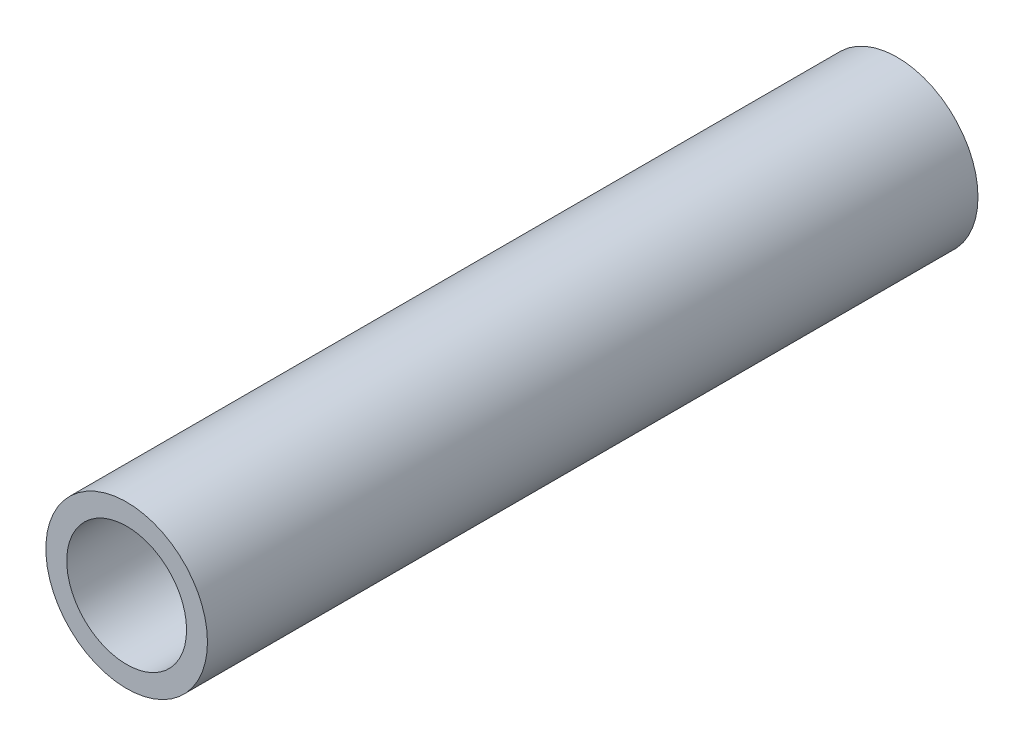
ISO-10303-21;
HEADER;
FILE_DESCRIPTION(('STEP AP214'),'2;1');
FILE_NAME('part.step','',(''),(''),'','','');
FILE_SCHEMA(('AUTOMOTIVE_DESIGN { 1 0 10303 214 1 1 1 1 }'));
ENDSEC;
DATA;
#1=APPLICATION_CONTEXT('core data for automotive mechanical design processes');
#2=APPLICATION_PROTOCOL_DEFINITION('international standard','automotive_design',2000,#1);
#3=PRODUCT_CONTEXT('',#1,'mechanical');
#4=PRODUCT('Part','Part','',(#3));
#5=PRODUCT_RELATED_PRODUCT_CATEGORY('part','',(#4));
#6=PRODUCT_DEFINITION_FORMATION('','',#4);
#7=PRODUCT_DEFINITION_CONTEXT('part definition',#1,'design');
#8=PRODUCT_DEFINITION('design','',#6,#7);
#9=PRODUCT_DEFINITION_SHAPE('','',#8);
#10=(LENGTH_UNIT() NAMED_UNIT(*) SI_UNIT(.MILLI.,.METRE.));
#11=(NAMED_UNIT(*) PLANE_ANGLE_UNIT() SI_UNIT($,.RADIAN.));
#12=(NAMED_UNIT(*) SI_UNIT($,.STERADIAN.) SOLID_ANGLE_UNIT());
#13=UNCERTAINTY_MEASURE_WITH_UNIT(LENGTH_MEASURE(1.E-05),#10,'distance_accuracy_value','');
#14=(GEOMETRIC_REPRESENTATION_CONTEXT(3) GLOBAL_UNCERTAINTY_ASSIGNED_CONTEXT((#13)) GLOBAL_UNIT_ASSIGNED_CONTEXT((#10,
#11,#12)) REPRESENTATION_CONTEXT('',''));
#15=CARTESIAN_POINT('',(0.,0.,0.));
#16=DIRECTION('',(0.,0.,1.));
#17=DIRECTION('',(1.,0.,0.));
#18=AXIS2_PLACEMENT_3D('',#15,#16,#17);
#19=CARTESIAN_POINT('',(0.,0.,101.6));
#20=DIRECTION('',(0.,0.,1.));
#21=DIRECTION('',(1.,0.,0.));
#22=AXIS2_PLACEMENT_3D('',#19,#20,#21);
#23=PLANE('',#22);
#24=CARTESIAN_POINT('',(0.,0.,101.6));
#25=DIRECTION('',(0.,0.,1.));
#26=DIRECTION('',(1.,0.,0.));
#27=AXIS2_PLACEMENT_3D('',#24,#25,#26);
#28=CIRCLE('',#27,10.6553);
#29=CARTESIAN_POINT('',(10.6553,0.,101.6));
#30=VERTEX_POINT('',#29);
#31=EDGE_CURVE('E10',#30,#30,#28,.T.);
#32=ORIENTED_EDGE('',*,*,#31,.T.);
#33=EDGE_LOOP('',(#32));
#34=FACE_BOUND('',#33,.T.);
#35=CARTESIAN_POINT('',(0.,0.,101.6));
#36=DIRECTION('',(0.,0.,1.));
#37=DIRECTION('',(1.,0.,0.));
#38=AXIS2_PLACEMENT_3D('',#35,#36,#37);
#39=CIRCLE('',#38,7.8994);
#40=CARTESIAN_POINT('',(7.8994,0.,101.6));
#41=VERTEX_POINT('',#40);
#42=EDGE_CURVE('E41',#41,#41,#39,.T.);
#43=ORIENTED_EDGE('',*,*,#42,.F.);
#44=EDGE_LOOP('',(#43));
#45=FACE_BOUND('',#44,.T.);
#46=ADVANCED_FACE('F30',(#34,#45),#23,.T.);
#47=CARTESIAN_POINT('',(0.,0.,0.));
#48=DIRECTION('',(0.,0.,1.));
#49=DIRECTION('',(1.,0.,0.));
#50=AXIS2_PLACEMENT_3D('',#47,#48,#49);
#51=PLANE('',#50);
#52=CARTESIAN_POINT('',(0.,0.,0.));
#53=DIRECTION('',(0.,0.,1.));
#54=DIRECTION('',(1.,0.,0.));
#55=AXIS2_PLACEMENT_3D('',#52,#53,#54);
#56=CIRCLE('',#55,10.6553);
#57=CARTESIAN_POINT('',(10.6553,0.,0.));
#58=VERTEX_POINT('',#57);
#59=EDGE_CURVE('E34',#58,#58,#56,.T.);
#60=ORIENTED_EDGE('',*,*,#59,.F.);
#61=EDGE_LOOP('',(#60));
#62=FACE_BOUND('',#61,.T.);
#63=CARTESIAN_POINT('',(0.,0.,0.));
#64=DIRECTION('',(0.,0.,1.));
#65=DIRECTION('',(1.,0.,0.));
#66=AXIS2_PLACEMENT_3D('',#63,#64,#65);
#67=CIRCLE('',#66,7.8994);
#68=CARTESIAN_POINT('',(7.8994,0.,0.));
#69=VERTEX_POINT('',#68);
#70=EDGE_CURVE('E43',#69,#69,#67,.T.);
#71=ORIENTED_EDGE('',*,*,#70,.T.);
#72=EDGE_LOOP('',(#71));
#73=FACE_BOUND('',#72,.T.);
#74=ADVANCED_FACE('F53',(#62,#73),#51,.F.);
#75=CARTESIAN_POINT('',(0.,0.,101.6));
#76=DIRECTION('',(0.,0.,-1.));
#77=DIRECTION('',(-1.,0.,0.));
#78=AXIS2_PLACEMENT_3D('',#75,#76,#77);
#79=CYLINDRICAL_SURFACE('',#78,10.6553);
#80=ORIENTED_EDGE('',*,*,#31,.F.);
#81=EDGE_LOOP('',(#80));
#82=FACE_BOUND('',#81,.T.);
#83=ORIENTED_EDGE('',*,*,#59,.T.);
#84=EDGE_LOOP('',(#83));
#85=FACE_BOUND('',#84,.T.);
#86=ADVANCED_FACE('F32',(#82,#85),#79,.T.);
#87=CARTESIAN_POINT('',(0.,0.,101.6));
#88=DIRECTION('',(0.,0.,-1.));
#89=DIRECTION('',(-1.,0.,0.));
#90=AXIS2_PLACEMENT_3D('',#87,#88,#89);
#91=CYLINDRICAL_SURFACE('',#90,7.8994);
#92=ORIENTED_EDGE('',*,*,#42,.T.);
#93=EDGE_LOOP('',(#92));
#94=FACE_BOUND('',#93,.T.);
#95=ORIENTED_EDGE('',*,*,#70,.F.);
#96=EDGE_LOOP('',(#95));
#97=FACE_BOUND('',#96,.T.);
#98=ADVANCED_FACE('F49',(#94,#97),#91,.F.);
#99=CLOSED_SHELL('',(#46,#74,#86,#98));
#100=MANIFOLD_SOLID_BREP('B2',#99);
#101=ADVANCED_BREP_SHAPE_REPRESENTATION('',(#18,#100),#14);
#102=SHAPE_DEFINITION_REPRESENTATION(#9,#101);
ENDSEC;
END-ISO-10303-21;
